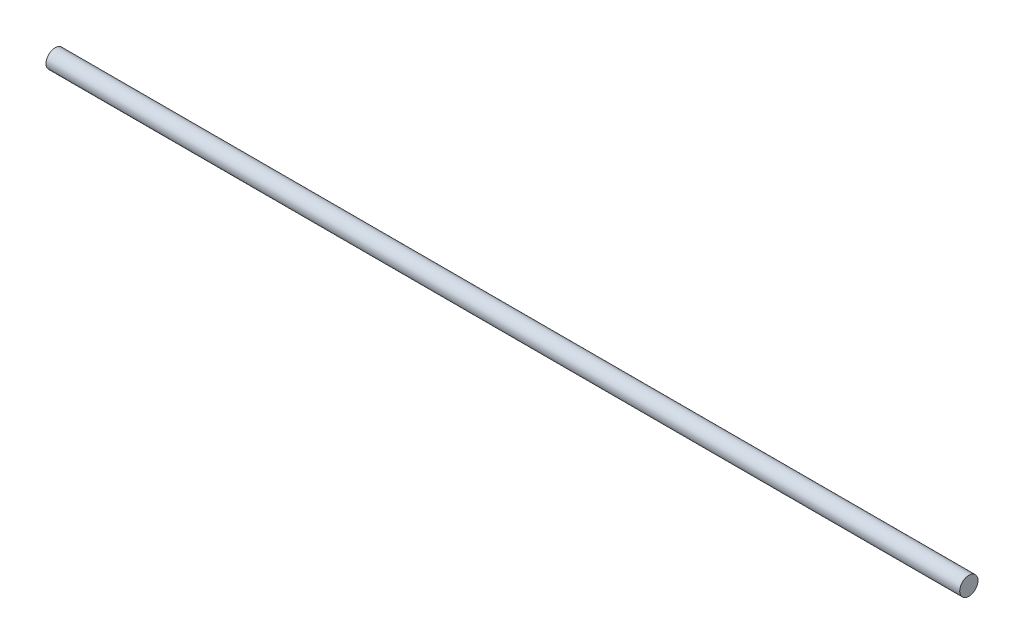
ISO-10303-21;
HEADER;
FILE_DESCRIPTION(('STEP AP214'),'2;1');
FILE_NAME('part.step','',(''),(''),'','','');
FILE_SCHEMA(('AUTOMOTIVE_DESIGN { 1 0 10303 214 1 1 1 1 }'));
ENDSEC;
DATA;
#1=APPLICATION_CONTEXT('core data for automotive mechanical design processes');
#2=APPLICATION_PROTOCOL_DEFINITION('international standard','automotive_design',2000,#1);
#3=PRODUCT_CONTEXT('',#1,'mechanical');
#4=PRODUCT('Part','Part','',(#3));
#5=PRODUCT_RELATED_PRODUCT_CATEGORY('part','',(#4));
#6=PRODUCT_DEFINITION_FORMATION('','',#4);
#7=PRODUCT_DEFINITION_CONTEXT('part definition',#1,'design');
#8=PRODUCT_DEFINITION('design','',#6,#7);
#9=PRODUCT_DEFINITION_SHAPE('','',#8);
#10=(LENGTH_UNIT() NAMED_UNIT(*) SI_UNIT(.MILLI.,.METRE.));
#11=(NAMED_UNIT(*) PLANE_ANGLE_UNIT() SI_UNIT($,.RADIAN.));
#12=(NAMED_UNIT(*) SI_UNIT($,.STERADIAN.) SOLID_ANGLE_UNIT());
#13=UNCERTAINTY_MEASURE_WITH_UNIT(LENGTH_MEASURE(1.E-05),#10,'distance_accuracy_value','');
#14=(GEOMETRIC_REPRESENTATION_CONTEXT(3) GLOBAL_UNCERTAINTY_ASSIGNED_CONTEXT((#13)) GLOBAL_UNIT_ASSIGNED_CONTEXT((#10,
#11,#12)) REPRESENTATION_CONTEXT('',''));
#15=CARTESIAN_POINT('',(0.,0.,0.));
#16=DIRECTION('',(0.,0.,1.));
#17=DIRECTION('',(1.,0.,0.));
#18=AXIS2_PLACEMENT_3D('',#15,#16,#17);
#19=CARTESIAN_POINT('',(400.,0.,0.));
#20=DIRECTION('',(-1.,0.,0.));
#21=DIRECTION('',(0.,0.,1.));
#22=AXIS2_PLACEMENT_3D('',#19,#20,#21);
#23=CYLINDRICAL_SURFACE('',#22,4.);
#24=CARTESIAN_POINT('',(400.,0.,0.));
#25=DIRECTION('',(1.,0.,0.));
#26=DIRECTION('',(0.,0.,-1.));
#27=AXIS2_PLACEMENT_3D('',#24,#25,#26);
#28=CIRCLE('',#27,4.);
#29=CARTESIAN_POINT('',(400.,0.,-4.));
#30=VERTEX_POINT('',#29);
#31=EDGE_CURVE('E10',#30,#30,#28,.T.);
#32=ORIENTED_EDGE('',*,*,#31,.F.);
#33=EDGE_LOOP('',(#32));
#34=FACE_BOUND('',#33,.T.);
#35=CARTESIAN_POINT('',(0.,0.,0.));
#36=DIRECTION('',(1.,0.,0.));
#37=DIRECTION('',(0.,0.,-1.));
#38=AXIS2_PLACEMENT_3D('',#35,#36,#37);
#39=CIRCLE('',#38,4.);
#40=CARTESIAN_POINT('',(0.,0.,-4.));
#41=VERTEX_POINT('',#40);
#42=EDGE_CURVE('E36',#41,#41,#39,.T.);
#43=ORIENTED_EDGE('',*,*,#42,.T.);
#44=EDGE_LOOP('',(#43));
#45=FACE_BOUND('',#44,.T.);
#46=ADVANCED_FACE('F33',(#34,#45),#23,.T.);
#47=CARTESIAN_POINT('',(400.,0.,0.));
#48=DIRECTION('',(1.,0.,0.));
#49=DIRECTION('',(0.,0.,-1.));
#50=AXIS2_PLACEMENT_3D('',#47,#48,#49);
#51=PLANE('',#50);
#52=ORIENTED_EDGE('',*,*,#31,.T.);
#53=EDGE_LOOP('',(#52));
#54=FACE_BOUND('',#53,.T.);
#55=ADVANCED_FACE('F48',(#54),#51,.T.);
#56=CARTESIAN_POINT('',(0.,0.,0.));
#57=DIRECTION('',(1.,0.,0.));
#58=DIRECTION('',(0.,0.,-1.));
#59=AXIS2_PLACEMENT_3D('',#56,#57,#58);
#60=PLANE('',#59);
#61=ORIENTED_EDGE('',*,*,#42,.F.);
#62=EDGE_LOOP('',(#61));
#63=FACE_BOUND('',#62,.T.);
#64=ADVANCED_FACE('F46',(#63),#60,.F.);
#65=CLOSED_SHELL('',(#46,#55,#64));
#66=MANIFOLD_SOLID_BREP('B2',#65);
#67=ADVANCED_BREP_SHAPE_REPRESENTATION('',(#18,#66),#14);
#68=SHAPE_DEFINITION_REPRESENTATION(#9,#67);
ENDSEC;
END-ISO-10303-21;
